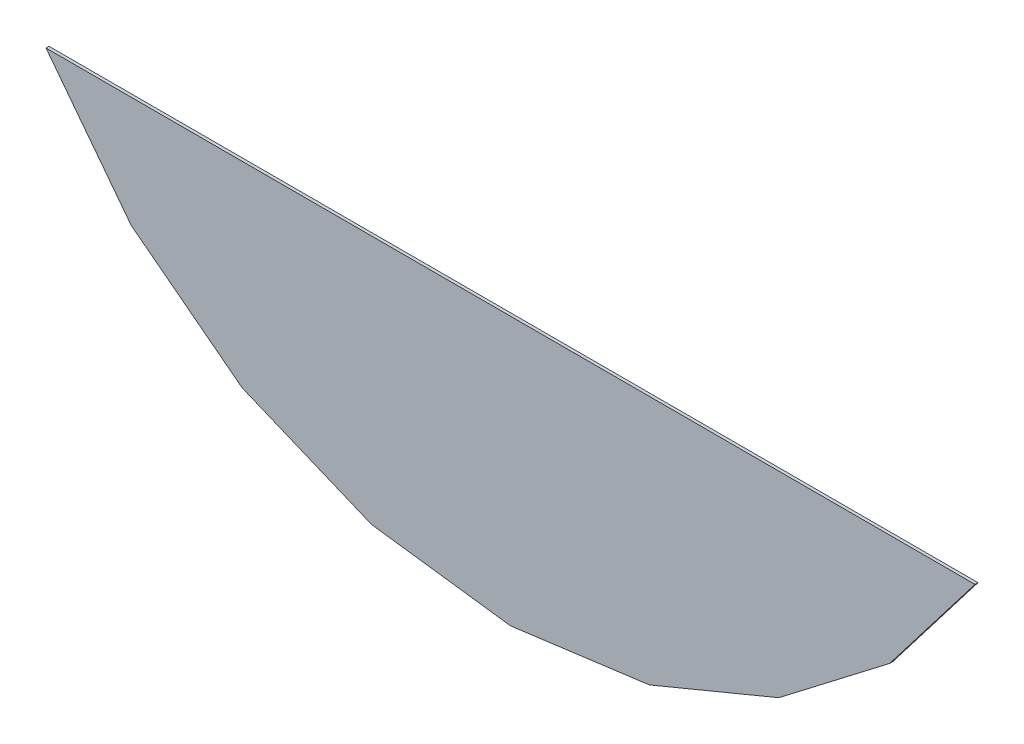
ISO-10303-21;
HEADER;
FILE_DESCRIPTION(('STEP AP214'),'2;1');
FILE_NAME('part.step','',(''),(''),'','','');
FILE_SCHEMA(('AUTOMOTIVE_DESIGN { 1 0 10303 214 1 1 1 1 }'));
ENDSEC;
DATA;
#1=APPLICATION_CONTEXT('core data for automotive mechanical design processes');
#2=APPLICATION_PROTOCOL_DEFINITION('international standard','automotive_design',2000,#1);
#3=PRODUCT_CONTEXT('',#1,'mechanical');
#4=PRODUCT('Part','Part','',(#3));
#5=PRODUCT_RELATED_PRODUCT_CATEGORY('part','',(#4));
#6=PRODUCT_DEFINITION_FORMATION('','',#4);
#7=PRODUCT_DEFINITION_CONTEXT('part definition',#1,'design');
#8=PRODUCT_DEFINITION('design','',#6,#7);
#9=PRODUCT_DEFINITION_SHAPE('','',#8);
#10=(LENGTH_UNIT() NAMED_UNIT(*) SI_UNIT(.MILLI.,.METRE.));
#11=(NAMED_UNIT(*) PLANE_ANGLE_UNIT() SI_UNIT($,.RADIAN.));
#12=(NAMED_UNIT(*) SI_UNIT($,.STERADIAN.) SOLID_ANGLE_UNIT());
#13=UNCERTAINTY_MEASURE_WITH_UNIT(LENGTH_MEASURE(1.E-05),#10,'distance_accuracy_value','');
#14=(GEOMETRIC_REPRESENTATION_CONTEXT(3) GLOBAL_UNCERTAINTY_ASSIGNED_CONTEXT((#13)) GLOBAL_UNIT_ASSIGNED_CONTEXT((#10,
#11,#12)) REPRESENTATION_CONTEXT('',''));
#15=CARTESIAN_POINT('',(0.,0.,0.));
#16=DIRECTION('',(0.,0.,1.));
#17=DIRECTION('',(1.,0.,0.));
#18=AXIS2_PLACEMENT_3D('',#15,#16,#17);
#19=CARTESIAN_POINT('',(-1.5588488,-2.74280376,3.9099998));
#20=DIRECTION('',(0.,0.,1.));
#21=DIRECTION('',(1.,0.,0.));
#22=AXIS2_PLACEMENT_3D('',#19,#20,#21);
#23=PLANE('',#22);
#24=DIRECTION('',(0.923880918501274,0.382680086272127,0.));
#25=VECTOR('',#24,1.);
#26=CARTESIAN_POINT('',(0.465871559999998,-3.58146857999999,3.9099998));
#27=LINE('',#26,#25);
#28=CARTESIAN_POINT('',(0.465871559999994,-3.58146857999999,3.9099998));
#29=VERTEX_POINT('',#28);
#30=CARTESIAN_POINT('',(0.899998200000019,-3.40164928000002,3.9099998));
#31=VERTEX_POINT('',#30);
#32=EDGE_CURVE('E90',#29,#31,#27,.T.);
#33=ORIENTED_EDGE('',*,*,#32,.T.);
#34=DIRECTION('',(0.793350853310934,0.608764670090842,0.));
#35=VECTOR('',#34,1.);
#36=CARTESIAN_POINT('',(0.899998200000011,-3.40164928000002,3.9099998));
#37=LINE('',#36,#35);
#38=CARTESIAN_POINT('',(1.27278891999998,-3.11559447999998,3.9099998));
#39=VERTEX_POINT('',#38);
#40=EDGE_CURVE('E87',#31,#39,#37,.T.);
#41=ORIENTED_EDGE('',*,*,#40,.T.);
#42=DIRECTION('',(0.60876467009081,0.793350853310959,0.));
#43=VECTOR('',#42,1.);
#44=CARTESIAN_POINT('',(1.27278891999998,-3.11559447999999,3.9099998));
#45=LINE('',#44,#43);
#46=CARTESIAN_POINT('',(1.55884372,-2.74280376,3.9099998));
#47=VERTEX_POINT('',#46);
#48=EDGE_CURVE('E19',#39,#47,#45,.T.);
#49=ORIENTED_EDGE('',*,*,#48,.T.);
#50=DIRECTION('',(1.,0.,0.));
#51=VECTOR('',#50,1.);
#52=CARTESIAN_POINT('',(-1.5588488,-2.74280376,3.9099998));
#53=LINE('',#52,#51);
#54=CARTESIAN_POINT('',(-1.55884880000005,-2.74280376000001,3.9099998));
#55=VERTEX_POINT('',#54);
#56=EDGE_CURVE('E93',#55,#47,#53,.T.);
#57=ORIENTED_EDGE('',*,*,#56,.F.);
#58=DIRECTION('',(0.608764670090875,-0.793350853310909,0.));
#59=VECTOR('',#58,1.);
#60=CARTESIAN_POINT('',(-1.55884880000003,-2.74280376000002,3.9099998));
#61=LINE('',#60,#59);
#62=CARTESIAN_POINT('',(-1.27279399999998,-3.11559447999997,3.9099998));
#63=VERTEX_POINT('',#62);
#64=EDGE_CURVE('E83',#55,#63,#61,.T.);
#65=ORIENTED_EDGE('',*,*,#64,.T.);
#66=DIRECTION('',(0.793350853310949,-0.608764670090824,0.));
#67=VECTOR('',#66,1.);
#68=CARTESIAN_POINT('',(-1.27279399999999,-3.11559447999998,3.9099998));
#69=LINE('',#68,#67);
#70=CARTESIAN_POINT('',(-0.900003280000005,-3.40164928000001,3.9099998));
#71=VERTEX_POINT('',#70);
#72=EDGE_CURVE('E104',#63,#71,#69,.T.);
#73=ORIENTED_EDGE('',*,*,#72,.T.);
#74=DIRECTION('',(0.923880918501224,-0.382680086272247,0.));
#75=VECTOR('',#74,1.);
#76=CARTESIAN_POINT('',(-0.900003280000004,-3.40164928000001,3.9099998));
#77=LINE('',#76,#75);
#78=CARTESIAN_POINT('',(-0.465876640000006,-3.58146858000007,3.9099998));
#79=VERTEX_POINT('',#78);
#80=EDGE_CURVE('E105',#71,#79,#77,.T.);
#81=ORIENTED_EDGE('',*,*,#80,.T.);
#82=DIRECTION('',(0.991444891344725,-0.130525964568151,0.));
#83=VECTOR('',#82,1.);
#84=CARTESIAN_POINT('',(-0.465876640000006,-3.58146858000004,3.9099998));
#85=LINE('',#84,#83);
#86=CARTESIAN_POINT('',(-2.54000000913607E-06,-3.64280195999994,3.9099998));
#87=VERTEX_POINT('',#86);
#88=EDGE_CURVE('E109',#79,#87,#85,.T.);
#89=ORIENTED_EDGE('',*,*,#88,.T.);
#90=DIRECTION('',(0.991444891344711,0.130525964568258,0.));
#91=VECTOR('',#90,1.);
#92=CARTESIAN_POINT('',(-2.54000000307793E-06,-3.64280195999996,3.9099998));
#93=LINE('',#92,#91);
#94=EDGE_CURVE('E111',#87,#29,#93,.T.);
#95=ORIENTED_EDGE('',*,*,#94,.T.);
#96=EDGE_LOOP('',(#33,#41,#49,#57,#65,#73,#81,#89,#95));
#97=FACE_BOUND('',#96,.T.);
#98=ADVANCED_FACE('F16',(#97),#23,.T.);
#99=CARTESIAN_POINT('',(-1.5588488,-2.74280376,3.89999982));
#100=DIRECTION('',(0.,1.,0.));
#101=DIRECTION('',(0.,0.,1.));
#102=AXIS2_PLACEMENT_3D('',#99,#100,#101);
#103=PLANE('',#102);
#104=DIRECTION('',(0.,0.,1.));
#105=VECTOR('',#104,1.);
#106=CARTESIAN_POINT('',(-1.55884880000006,-2.74280376000005,3.89999982));
#107=LINE('',#106,#105);
#108=CARTESIAN_POINT('',(-1.55884880000004,-2.74280376000001,3.89999982));
#109=VERTEX_POINT('',#108);
#110=EDGE_CURVE('E115',#55,#109,#107,.F.);
#111=ORIENTED_EDGE('',*,*,#110,.F.);
#112=ORIENTED_EDGE('',*,*,#56,.T.);
#113=DIRECTION('',(0.,0.,1.));
#114=VECTOR('',#113,1.);
#115=CARTESIAN_POINT('',(1.55884372,-2.74280376,3.89999982));
#116=LINE('',#115,#114);
#117=CARTESIAN_POINT('',(1.55884372,-2.74280376,3.89999982));
#118=VERTEX_POINT('',#117);
#119=EDGE_CURVE('E98',#118,#47,#116,.T.);
#120=ORIENTED_EDGE('',*,*,#119,.F.);
#121=DIRECTION('',(1.,0.,0.));
#122=VECTOR('',#121,1.);
#123=CARTESIAN_POINT('',(-1.5588488,-2.74280376,3.89999982));
#124=LINE('',#123,#122);
#125=EDGE_CURVE('E129',#118,#109,#124,.F.);
#126=ORIENTED_EDGE('',*,*,#125,.T.);
#127=EDGE_LOOP('',(#111,#112,#120,#126));
#128=FACE_BOUND('',#127,.T.);
#129=ADVANCED_FACE('F180',(#128),#103,.T.);
#130=CARTESIAN_POINT('',(-1.272794,-3.11559448,3.89999982));
#131=DIRECTION('',(-0.793350853310883,-0.60876467009091,0.));
#132=DIRECTION('',(0.60876467009091,-0.793350853310883,0.));
#133=AXIS2_PLACEMENT_3D('',#130,#131,#132);
#134=PLANE('',#133);
#135=DIRECTION('',(0.,0.,1.));
#136=VECTOR('',#135,1.);
#137=CARTESIAN_POINT('',(-1.27279399999995,-3.11559447999994,3.89999982));
#138=LINE('',#137,#136);
#139=CARTESIAN_POINT('',(-1.27279399999999,-3.11559447999998,3.89999982));
#140=VERTEX_POINT('',#139);
#141=EDGE_CURVE('E117',#63,#140,#138,.F.);
#142=ORIENTED_EDGE('',*,*,#141,.F.);
#143=ORIENTED_EDGE('',*,*,#64,.F.);
#144=ORIENTED_EDGE('',*,*,#110,.T.);
#145=DIRECTION('',(0.608764670090875,-0.793350853310909,0.));
#146=VECTOR('',#145,1.);
#147=CARTESIAN_POINT('',(-1.55884880000003,-2.74280376000002,3.89999982));
#148=LINE('',#147,#146);
#149=EDGE_CURVE('E132',#109,#140,#148,.T.);
#150=ORIENTED_EDGE('',*,*,#149,.T.);
#151=EDGE_LOOP('',(#142,#143,#144,#150));
#152=FACE_BOUND('',#151,.T.);
#153=ADVANCED_FACE('F177',(#152),#134,.T.);
#154=CARTESIAN_POINT('',(-0.90000328,-3.40164928,3.89999982));
#155=DIRECTION('',(-0.60876467009091,-0.793350853310883,0.));
#156=DIRECTION('',(0.793350853310883,-0.60876467009091,0.));
#157=AXIS2_PLACEMENT_3D('',#154,#155,#156);
#158=PLANE('',#157);
#159=DIRECTION('',(0.,0.,1.));
#160=VECTOR('',#159,1.);
#161=CARTESIAN_POINT('',(-0.900003280000014,-3.40164928000003,3.89999982));
#162=LINE('',#161,#160);
#163=CARTESIAN_POINT('',(-0.900003280000004,-3.40164928000001,3.89999982));
#164=VERTEX_POINT('',#163);
#165=EDGE_CURVE('E119',#71,#164,#162,.F.);
#166=ORIENTED_EDGE('',*,*,#165,.F.);
#167=ORIENTED_EDGE('',*,*,#72,.F.);
#168=ORIENTED_EDGE('',*,*,#141,.T.);
#169=DIRECTION('',(0.793350853310949,-0.608764670090823,0.));
#170=VECTOR('',#169,1.);
#171=CARTESIAN_POINT('',(-1.27279399999999,-3.11559447999998,3.89999982));
#172=LINE('',#171,#170);
#173=EDGE_CURVE('E135',#140,#164,#172,.T.);
#174=ORIENTED_EDGE('',*,*,#173,.T.);
#175=EDGE_LOOP('',(#166,#167,#168,#174));
#176=FACE_BOUND('',#175,.T.);
#177=ADVANCED_FACE('F174',(#176),#158,.T.);
#178=CARTESIAN_POINT('',(-0.46587664,-3.58146858,3.89999982));
#179=DIRECTION('',(-0.382680086272115,-0.923880918501279,0.));
#180=DIRECTION('',(0.923880918501279,-0.382680086272115,0.));
#181=AXIS2_PLACEMENT_3D('',#178,#179,#180);
#182=PLANE('',#181);
#183=DIRECTION('',(0.,0.,1.));
#184=VECTOR('',#183,1.);
#185=CARTESIAN_POINT('',(-0.465876640000023,-3.58146858000017,3.89999982));
#186=LINE('',#185,#184);
#187=CARTESIAN_POINT('',(-0.465876640000002,-3.58146858000006,3.89999982));
#188=VERTEX_POINT('',#187);
#189=EDGE_CURVE('E121',#79,#188,#186,.F.);
#190=ORIENTED_EDGE('',*,*,#189,.F.);
#191=ORIENTED_EDGE('',*,*,#80,.F.);
#192=ORIENTED_EDGE('',*,*,#165,.T.);
#193=DIRECTION('',(0.923880918501224,-0.382680086272247,0.));
#194=VECTOR('',#193,1.);
#195=CARTESIAN_POINT('',(-0.900003280000004,-3.40164928000001,3.89999982));
#196=LINE('',#195,#194);
#197=EDGE_CURVE('E138',#164,#188,#196,.T.);
#198=ORIENTED_EDGE('',*,*,#197,.T.);
#199=EDGE_LOOP('',(#190,#191,#192,#198));
#200=FACE_BOUND('',#199,.T.);
#201=ADVANCED_FACE('F169',(#200),#182,.T.);
#202=CARTESIAN_POINT('',(-2.539999996998E-06,-3.64280196,3.89999982));
#203=DIRECTION('',(-0.130525964567967,-0.991444891344749,0.));
#204=DIRECTION('',(0.991444891344749,-0.130525964567967,0.));
#205=AXIS2_PLACEMENT_3D('',#202,#203,#204);
#206=PLANE('',#205);
#207=DIRECTION('',(0.,0.,1.));
#208=VECTOR('',#207,1.);
#209=CARTESIAN_POINT('',(-2.5400000200999E-06,-3.64280195999983,3.89999982));
#210=LINE('',#209,#208);
#211=CARTESIAN_POINT('',(-2.54000000989683E-06,-3.64280195999995,3.89999982));
#212=VERTEX_POINT('',#211);
#213=EDGE_CURVE('E123',#87,#212,#210,.F.);
#214=ORIENTED_EDGE('',*,*,#213,.F.);
#215=ORIENTED_EDGE('',*,*,#88,.F.);
#216=ORIENTED_EDGE('',*,*,#189,.T.);
#217=DIRECTION('',(0.991444891344725,-0.130525964568151,0.));
#218=VECTOR('',#217,1.);
#219=CARTESIAN_POINT('',(-0.465876640000006,-3.58146858000004,3.89999982));
#220=LINE('',#219,#218);
#221=EDGE_CURVE('E141',#188,#212,#220,.T.);
#222=ORIENTED_EDGE('',*,*,#221,.T.);
#223=EDGE_LOOP('',(#214,#215,#216,#222));
#224=FACE_BOUND('',#223,.T.);
#225=ADVANCED_FACE('F164',(#224),#206,.T.);
#226=CARTESIAN_POINT('',(0.46587156,-3.58146858,3.89999982));
#227=DIRECTION('',(0.130525964567967,-0.991444891344749,0.));
#228=DIRECTION('',(0.991444891344749,0.130525964567967,0.));
#229=AXIS2_PLACEMENT_3D('',#226,#227,#228);
#230=PLANE('',#229);
#231=DIRECTION('',(0.,0.,1.));
#232=VECTOR('',#231,1.);
#233=CARTESIAN_POINT('',(0.465871559999989,-3.58146857999997,3.89999982));
#234=LINE('',#233,#232);
#235=CARTESIAN_POINT('',(0.465871559999996,-3.58146857999999,3.89999982));
#236=VERTEX_POINT('',#235);
#237=EDGE_CURVE('E125',#29,#236,#234,.F.);
#238=ORIENTED_EDGE('',*,*,#237,.F.);
#239=ORIENTED_EDGE('',*,*,#94,.F.);
#240=ORIENTED_EDGE('',*,*,#213,.T.);
#241=DIRECTION('',(0.991444891344711,0.130525964568257,0.));
#242=VECTOR('',#241,1.);
#243=CARTESIAN_POINT('',(-2.54000000286109E-06,-3.64280195999996,3.89999982));
#244=LINE('',#243,#242);
#245=EDGE_CURVE('E144',#212,#236,#244,.T.);
#246=ORIENTED_EDGE('',*,*,#245,.T.);
#247=EDGE_LOOP('',(#238,#239,#240,#246));
#248=FACE_BOUND('',#247,.T.);
#249=ADVANCED_FACE('F159',(#248),#230,.T.);
#250=CARTESIAN_POINT('',(0.8999982,-3.40164928,3.89999982));
#251=DIRECTION('',(0.382680086272115,-0.923880918501279,0.));
#252=DIRECTION('',(0.923880918501279,0.382680086272115,0.));
#253=AXIS2_PLACEMENT_3D('',#250,#251,#252);
#254=PLANE('',#253);
#255=DIRECTION('',(0.,0.,1.));
#256=VECTOR('',#255,1.);
#257=CARTESIAN_POINT('',(0.899998200000047,-3.40164928000006,3.89999982));
#258=LINE('',#257,#256);
#259=CARTESIAN_POINT('',(0.899998200000017,-3.40164928000002,3.89999982));
#260=VERTEX_POINT('',#259);
#261=EDGE_CURVE('E99',#31,#260,#258,.F.);
#262=ORIENTED_EDGE('',*,*,#261,.F.);
#263=ORIENTED_EDGE('',*,*,#32,.F.);
#264=ORIENTED_EDGE('',*,*,#237,.T.);
#265=DIRECTION('',(0.923880918501273,0.382680086272128,0.));
#266=VECTOR('',#265,1.);
#267=CARTESIAN_POINT('',(0.465871559999997,-3.58146857999999,3.89999982));
#268=LINE('',#267,#266);
#269=EDGE_CURVE('E147',#236,#260,#268,.T.);
#270=ORIENTED_EDGE('',*,*,#269,.T.);
#271=EDGE_LOOP('',(#262,#263,#264,#270));
#272=FACE_BOUND('',#271,.T.);
#273=ADVANCED_FACE('F152',(#272),#254,.T.);
#274=CARTESIAN_POINT('',(1.27278892,-3.11559448,3.89999982));
#275=DIRECTION('',(0.60876467009091,-0.793350853310883,0.));
#276=DIRECTION('',(0.793350853310883,0.60876467009091,0.));
#277=AXIS2_PLACEMENT_3D('',#274,#275,#276);
#278=PLANE('',#277);
#279=DIRECTION('',(0.,0.,1.));
#280=VECTOR('',#279,1.);
#281=CARTESIAN_POINT('',(1.27278891999994,-3.11559447999995,3.89999982));
#282=LINE('',#281,#280);
#283=CARTESIAN_POINT('',(1.27278891999998,-3.11559447999999,3.89999982));
#284=VERTEX_POINT('',#283);
#285=EDGE_CURVE('E33',#39,#284,#282,.F.);
#286=ORIENTED_EDGE('',*,*,#285,.F.);
#287=ORIENTED_EDGE('',*,*,#40,.F.);
#288=ORIENTED_EDGE('',*,*,#261,.T.);
#289=DIRECTION('',(0.793350853310935,0.608764670090842,0.));
#290=VECTOR('',#289,1.);
#291=CARTESIAN_POINT('',(0.899998200000011,-3.40164928000002,3.89999982));
#292=LINE('',#291,#290);
#293=EDGE_CURVE('E25',#260,#284,#292,.T.);
#294=ORIENTED_EDGE('',*,*,#293,.T.);
#295=EDGE_LOOP('',(#286,#287,#288,#294));
#296=FACE_BOUND('',#295,.T.);
#297=ADVANCED_FACE('F96',(#296),#278,.T.);
#298=CARTESIAN_POINT('',(1.55884372,-2.74280376,3.89999982));
#299=DIRECTION('',(0.793350853310883,-0.60876467009091,0.));
#300=DIRECTION('',(0.60876467009091,0.793350853310883,0.));
#301=AXIS2_PLACEMENT_3D('',#298,#299,#300);
#302=PLANE('',#301);
#303=ORIENTED_EDGE('',*,*,#119,.T.);
#304=ORIENTED_EDGE('',*,*,#48,.F.);
#305=ORIENTED_EDGE('',*,*,#285,.T.);
#306=DIRECTION('',(0.60876467009081,0.793350853310959,0.));
#307=VECTOR('',#306,1.);
#308=CARTESIAN_POINT('',(1.27278891999998,-3.11559447999999,3.89999982));
#309=LINE('',#308,#307);
#310=EDGE_CURVE('E11',#284,#118,#309,.T.);
#311=ORIENTED_EDGE('',*,*,#310,.T.);
#312=EDGE_LOOP('',(#303,#304,#305,#311));
#313=FACE_BOUND('',#312,.T.);
#314=ADVANCED_FACE('F102',(#313),#302,.T.);
#315=CARTESIAN_POINT('',(-1.5588488,-2.74280376,3.89999982));
#316=DIRECTION('',(0.,0.,1.));
#317=DIRECTION('',(1.,0.,0.));
#318=AXIS2_PLACEMENT_3D('',#315,#316,#317);
#319=PLANE('',#318);
#320=ORIENTED_EDGE('',*,*,#293,.F.);
#321=ORIENTED_EDGE('',*,*,#269,.F.);
#322=ORIENTED_EDGE('',*,*,#245,.F.);
#323=ORIENTED_EDGE('',*,*,#221,.F.);
#324=ORIENTED_EDGE('',*,*,#197,.F.);
#325=ORIENTED_EDGE('',*,*,#173,.F.);
#326=ORIENTED_EDGE('',*,*,#149,.F.);
#327=ORIENTED_EDGE('',*,*,#125,.F.);
#328=ORIENTED_EDGE('',*,*,#310,.F.);
#329=EDGE_LOOP('',(#320,#321,#322,#323,#324,#325,#326,#327,#328));
#330=FACE_BOUND('',#329,.T.);
#331=ADVANCED_FACE('F156',(#330),#319,.F.);
#332=CLOSED_SHELL('',(#98,#129,#153,#177,#201,#225,#249,#273,#297,#314,#331));
#333=MANIFOLD_SOLID_BREP('B1',#332);
#334=ADVANCED_BREP_SHAPE_REPRESENTATION('',(#18,#333),#14);
#335=SHAPE_DEFINITION_REPRESENTATION(#9,#334);
ENDSEC;
END-ISO-10303-21;
